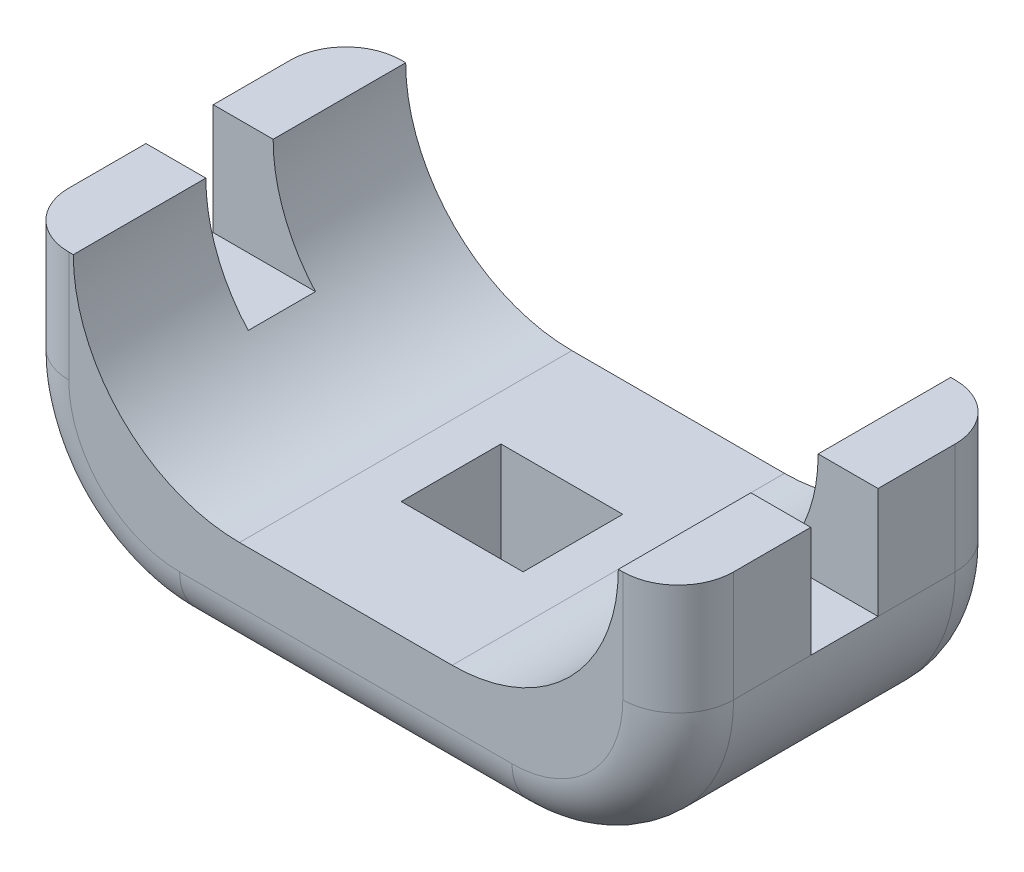
ISO-10303-21;
HEADER;
FILE_DESCRIPTION(('STEP AP214'),'2;1');
FILE_NAME('part.step','',(''),(''),'','','');
FILE_SCHEMA(('AUTOMOTIVE_DESIGN { 1 0 10303 214 1 1 1 1 }'));
ENDSEC;
DATA;
#1=APPLICATION_CONTEXT('core data for automotive mechanical design processes');
#2=APPLICATION_PROTOCOL_DEFINITION('international standard','automotive_design',2000,#1);
#3=PRODUCT_CONTEXT('',#1,'mechanical');
#4=PRODUCT('Part','Part','',(#3));
#5=PRODUCT_RELATED_PRODUCT_CATEGORY('part','',(#4));
#6=PRODUCT_DEFINITION_FORMATION('','',#4);
#7=PRODUCT_DEFINITION_CONTEXT('part definition',#1,'design');
#8=PRODUCT_DEFINITION('design','',#6,#7);
#9=PRODUCT_DEFINITION_SHAPE('','',#8);
#10=(LENGTH_UNIT() NAMED_UNIT(*) SI_UNIT(.MILLI.,.METRE.));
#11=(NAMED_UNIT(*) PLANE_ANGLE_UNIT() SI_UNIT($,.RADIAN.));
#12=(NAMED_UNIT(*) SI_UNIT($,.STERADIAN.) SOLID_ANGLE_UNIT());
#13=UNCERTAINTY_MEASURE_WITH_UNIT(LENGTH_MEASURE(1.E-05),#10,'distance_accuracy_value','');
#14=(GEOMETRIC_REPRESENTATION_CONTEXT(3) GLOBAL_UNCERTAINTY_ASSIGNED_CONTEXT((#13)) GLOBAL_UNIT_ASSIGNED_CONTEXT((#10,
#11,#12)) REPRESENTATION_CONTEXT('',''));
#15=CARTESIAN_POINT('',(0.,0.,0.));
#16=DIRECTION('',(0.,0.,1.));
#17=DIRECTION('',(1.,0.,0.));
#18=AXIS2_PLACEMENT_3D('',#15,#16,#17);
#19=CARTESIAN_POINT('',(0.,5.,0.));
#20=DIRECTION('',(0.,1.,0.));
#21=DIRECTION('',(0.,0.,1.));
#22=AXIS2_PLACEMENT_3D('',#19,#20,#21);
#23=PLANE('',#22);
#24=DIRECTION('',(1.,0.,0.));
#25=VECTOR('',#24,1.);
#26=CARTESIAN_POINT('',(-6.,5.,0.607288579290806));
#27=LINE('',#26,#25);
#28=CARTESIAN_POINT('',(4.91903749225539,5.,0.607288579290806));
#29=VERTEX_POINT('',#28);
#30=CARTESIAN_POINT('',(6.,5.,0.607288579290806));
#31=VERTEX_POINT('',#30);
#32=EDGE_CURVE('E395',#29,#31,#27,.T.);
#33=ORIENTED_EDGE('',*,*,#32,.F.);
#34=DIRECTION('',(0.,0.,-1.));
#35=VECTOR('',#34,1.);
#36=CARTESIAN_POINT('',(4.9190374922554,5.,3.));
#37=LINE('',#36,#35);
#38=CARTESIAN_POINT('',(4.9190374922554,5.,3.));
#39=VERTEX_POINT('',#38);
#40=EDGE_CURVE('E418',#39,#29,#37,.T.);
#41=ORIENTED_EDGE('',*,*,#40,.F.);
#42=DIRECTION('',(1.,0.,0.));
#43=VECTOR('',#42,1.);
#44=CARTESIAN_POINT('',(6.,5.,3.));
#45=LINE('',#44,#43);
#46=CARTESIAN_POINT('',(5.,5.,3.));
#47=VERTEX_POINT('',#46);
#48=EDGE_CURVE('E453',#39,#47,#45,.T.);
#49=ORIENTED_EDGE('',*,*,#48,.T.);
#50=CARTESIAN_POINT('',(5.,5.,2.));
#51=DIRECTION('',(0.,1.,0.));
#52=DIRECTION('',(0.,0.,1.));
#53=AXIS2_PLACEMENT_3D('',#50,#51,#52);
#54=CIRCLE('',#53,1.);
#55=CARTESIAN_POINT('',(6.,5.,2.));
#56=VERTEX_POINT('',#55);
#57=EDGE_CURVE('E356',#47,#56,#54,.T.);
#58=ORIENTED_EDGE('',*,*,#57,.T.);
#59=DIRECTION('',(0.,0.,-1.));
#60=VECTOR('',#59,1.);
#61=CARTESIAN_POINT('',(6.,5.,3.));
#62=LINE('',#61,#60);
#63=EDGE_CURVE('E456',#56,#31,#62,.T.);
#64=ORIENTED_EDGE('',*,*,#63,.T.);
#65=EDGE_LOOP('',(#33,#41,#49,#58,#64));
#66=FACE_BOUND('',#65,.T.);
#67=ADVANCED_FACE('F40',(#66),#23,.T.);
#68=CARTESIAN_POINT('',(-6.,5.,3.));
#69=DIRECTION('',(1.,0.,0.));
#70=DIRECTION('',(0.,0.,-1.));
#71=AXIS2_PLACEMENT_3D('',#68,#69,#70);
#72=PLANE('',#71);
#73=DIRECTION('',(0.,0.,1.));
#74=VECTOR('',#73,1.);
#75=CARTESIAN_POINT('',(-6.,5.,3.));
#76=LINE('',#75,#74);
#77=CARTESIAN_POINT('',(-6.,5.,0.607288579290806));
#78=VERTEX_POINT('',#77);
#79=CARTESIAN_POINT('',(-6.,5.,2.));
#80=VERTEX_POINT('',#79);
#81=EDGE_CURVE('E446',#78,#80,#76,.T.);
#82=ORIENTED_EDGE('',*,*,#81,.F.);
#83=DIRECTION('',(0.,1.,0.));
#84=VECTOR('',#83,1.);
#85=CARTESIAN_POINT('',(-6.,3.,0.607288579290806));
#86=LINE('',#85,#84);
#87=CARTESIAN_POINT('',(-6.,3.,0.607288579290806));
#88=VERTEX_POINT('',#87);
#89=EDGE_CURVE('E404',#88,#78,#86,.T.);
#90=ORIENTED_EDGE('',*,*,#89,.F.);
#91=DIRECTION('',(0.,0.,1.));
#92=VECTOR('',#91,1.);
#93=CARTESIAN_POINT('',(-6.,3.,3.));
#94=LINE('',#93,#92);
#95=CARTESIAN_POINT('',(-6.,3.,2.));
#96=VERTEX_POINT('',#95);
#97=EDGE_CURVE('E272',#88,#96,#94,.T.);
#98=ORIENTED_EDGE('',*,*,#97,.T.);
#99=DIRECTION('',(0.,-1.,0.));
#100=VECTOR('',#99,1.);
#101=CARTESIAN_POINT('',(-6.,5.,2.));
#102=LINE('',#101,#100);
#103=EDGE_CURVE('E344',#96,#80,#102,.F.);
#104=ORIENTED_EDGE('',*,*,#103,.T.);
#105=EDGE_LOOP('',(#82,#90,#98,#104));
#106=FACE_BOUND('',#105,.T.);
#107=ADVANCED_FACE('F491',(#106),#72,.F.);
#108=CARTESIAN_POINT('',(6.,5.,3.));
#109=DIRECTION('',(-1.,0.,0.));
#110=DIRECTION('',(0.,0.,1.));
#111=AXIS2_PLACEMENT_3D('',#108,#109,#110);
#112=PLANE('',#111);
#113=DIRECTION('',(0.,0.,-1.));
#114=VECTOR('',#113,1.);
#115=CARTESIAN_POINT('',(6.,3.,3.));
#116=LINE('',#115,#114);
#117=CARTESIAN_POINT('',(6.,3.,2.));
#118=VERTEX_POINT('',#117);
#119=CARTESIAN_POINT('',(6.,3.,0.607288579290806));
#120=VERTEX_POINT('',#119);
#121=EDGE_CURVE('E259',#118,#120,#116,.T.);
#122=ORIENTED_EDGE('',*,*,#121,.T.);
#123=DIRECTION('',(0.,1.,0.));
#124=VECTOR('',#123,1.);
#125=CARTESIAN_POINT('',(6.,3.,0.607288579290806));
#126=LINE('',#125,#124);
#127=EDGE_CURVE('E400',#120,#31,#126,.T.);
#128=ORIENTED_EDGE('',*,*,#127,.T.);
#129=ORIENTED_EDGE('',*,*,#63,.F.);
#130=DIRECTION('',(0.,-1.,0.));
#131=VECTOR('',#130,1.);
#132=CARTESIAN_POINT('',(6.,5.,2.));
#133=LINE('',#132,#131);
#134=EDGE_CURVE('E354',#56,#118,#133,.T.);
#135=ORIENTED_EDGE('',*,*,#134,.T.);
#136=EDGE_LOOP('',(#122,#128,#129,#135));
#137=FACE_BOUND('',#136,.T.);
#138=ADVANCED_FACE('F553',(#137),#112,.F.);
#139=CARTESIAN_POINT('',(-4.9190374922554,5.,0.607288579290806));
#140=VERTEX_POINT('',#139);
#141=EDGE_CURVE('E243',#78,#140,#27,.T.);
#142=ORIENTED_EDGE('',*,*,#141,.F.);
#143=ORIENTED_EDGE('',*,*,#81,.T.);
#144=CARTESIAN_POINT('',(-5.,5.,2.));
#145=DIRECTION('',(0.,1.,0.));
#146=DIRECTION('',(0.,0.,1.));
#147=AXIS2_PLACEMENT_3D('',#144,#145,#146);
#148=CIRCLE('',#147,1.);
#149=CARTESIAN_POINT('',(-5.,5.,3.));
#150=VERTEX_POINT('',#149);
#151=EDGE_CURVE('E347',#80,#150,#148,.T.);
#152=ORIENTED_EDGE('',*,*,#151,.T.);
#153=CARTESIAN_POINT('',(-4.9190374922554,5.,3.));
#154=VERTEX_POINT('',#153);
#155=EDGE_CURVE('E454',#150,#154,#45,.T.);
#156=ORIENTED_EDGE('',*,*,#155,.T.);
#157=DIRECTION('',(0.,0.,1.));
#158=VECTOR('',#157,1.);
#159=CARTESIAN_POINT('',(-4.9190374922554,5.,3.));
#160=LINE('',#159,#158);
#161=EDGE_CURVE('E421',#140,#154,#160,.T.);
#162=ORIENTED_EDGE('',*,*,#161,.F.);
#163=EDGE_LOOP('',(#142,#143,#152,#156,#162));
#164=FACE_BOUND('',#163,.T.);
#165=ADVANCED_FACE('F512',(#164),#23,.T.);
#166=DIRECTION('',(-1.,0.,0.));
#167=VECTOR('',#166,1.);
#168=CARTESIAN_POINT('',(-6.,5.,-0.607288579290806));
#169=LINE('',#168,#167);
#170=CARTESIAN_POINT('',(6.,5.,-0.607288579290806));
#171=VERTEX_POINT('',#170);
#172=CARTESIAN_POINT('',(4.91903749225539,5.,-0.607288579290806));
#173=VERTEX_POINT('',#172);
#174=EDGE_CURVE('E393',#171,#173,#169,.T.);
#175=ORIENTED_EDGE('',*,*,#174,.F.);
#176=CARTESIAN_POINT('',(6.,5.,-2.));
#177=VERTEX_POINT('',#176);
#178=EDGE_CURVE('E251',#171,#177,#62,.T.);
#179=ORIENTED_EDGE('',*,*,#178,.T.);
#180=CARTESIAN_POINT('',(5.,5.,-2.));
#181=DIRECTION('',(0.,1.,0.));
#182=DIRECTION('',(0.,0.,1.));
#183=AXIS2_PLACEMENT_3D('',#180,#181,#182);
#184=CIRCLE('',#183,1.);
#185=CARTESIAN_POINT('',(5.,5.,-3.));
#186=VERTEX_POINT('',#185);
#187=EDGE_CURVE('E308',#177,#186,#184,.T.);
#188=ORIENTED_EDGE('',*,*,#187,.T.);
#189=DIRECTION('',(-1.,0.,0.));
#190=VECTOR('',#189,1.);
#191=CARTESIAN_POINT('',(6.,5.,-3.));
#192=LINE('',#191,#190);
#193=CARTESIAN_POINT('',(4.9190374922554,5.,-3.));
#194=VERTEX_POINT('',#193);
#195=EDGE_CURVE('E260',#186,#194,#192,.T.);
#196=ORIENTED_EDGE('',*,*,#195,.T.);
#197=EDGE_CURVE('E333',#173,#194,#37,.T.);
#198=ORIENTED_EDGE('',*,*,#197,.F.);
#199=EDGE_LOOP('',(#175,#179,#188,#196,#198));
#200=FACE_BOUND('',#199,.T.);
#201=ADVANCED_FACE('F462',(#200),#23,.T.);
#202=CARTESIAN_POINT('',(-6.,3.,-2.));
#203=VERTEX_POINT('',#202);
#204=CARTESIAN_POINT('',(-6.,3.,-0.607288579290806));
#205=VERTEX_POINT('',#204);
#206=EDGE_CURVE('E273',#203,#205,#94,.T.);
#207=ORIENTED_EDGE('',*,*,#206,.T.);
#208=DIRECTION('',(0.,1.,0.));
#209=VECTOR('',#208,1.);
#210=CARTESIAN_POINT('',(-6.,3.,-0.607288579290806));
#211=LINE('',#210,#209);
#212=CARTESIAN_POINT('',(-6.,5.,-0.607288579290806));
#213=VERTEX_POINT('',#212);
#214=EDGE_CURVE('E252',#205,#213,#211,.T.);
#215=ORIENTED_EDGE('',*,*,#214,.T.);
#216=CARTESIAN_POINT('',(-6.,5.,-2.));
#217=VERTEX_POINT('',#216);
#218=EDGE_CURVE('E392',#217,#213,#76,.T.);
#219=ORIENTED_EDGE('',*,*,#218,.F.);
#220=DIRECTION('',(0.,-1.,0.));
#221=VECTOR('',#220,1.);
#222=CARTESIAN_POINT('',(-6.,5.,-2.));
#223=LINE('',#222,#221);
#224=EDGE_CURVE('E311',#217,#203,#223,.T.);
#225=ORIENTED_EDGE('',*,*,#224,.T.);
#226=EDGE_LOOP('',(#207,#215,#219,#225));
#227=FACE_BOUND('',#226,.T.);
#228=ADVANCED_FACE('F528',(#227),#72,.F.);
#229=CARTESIAN_POINT('',(6.,5.,3.));
#230=DIRECTION('',(0.,0.,-1.));
#231=DIRECTION('',(-1.,0.,0.));
#232=AXIS2_PLACEMENT_3D('',#229,#230,#231);
#233=PLANE('',#232);
#234=ORIENTED_EDGE('',*,*,#155,.F.);
#235=DIRECTION('',(0.,-1.,0.));
#236=VECTOR('',#235,1.);
#237=CARTESIAN_POINT('',(-5.,5.,3.));
#238=LINE('',#237,#236);
#239=CARTESIAN_POINT('',(-5.,3.,3.));
#240=VERTEX_POINT('',#239);
#241=EDGE_CURVE('E341',#150,#240,#238,.T.);
#242=ORIENTED_EDGE('',*,*,#241,.T.);
#243=CARTESIAN_POINT('',(-3.,3.,3.));
#244=DIRECTION('',(0.,0.,-1.));
#245=DIRECTION('',(-1.,0.,0.));
#246=AXIS2_PLACEMENT_3D('',#243,#244,#245);
#247=CIRCLE('',#246,2.);
#248=CARTESIAN_POINT('',(-3.,1.,3.));
#249=VERTEX_POINT('',#248);
#250=EDGE_CURVE('E339',#240,#249,#247,.F.);
#251=ORIENTED_EDGE('',*,*,#250,.T.);
#252=DIRECTION('',(1.,0.,0.));
#253=VECTOR('',#252,1.);
#254=CARTESIAN_POINT('',(6.,1.,3.));
#255=LINE('',#254,#253);
#256=CARTESIAN_POINT('',(3.,1.,3.));
#257=VERTEX_POINT('',#256);
#258=EDGE_CURVE('E337',#249,#257,#255,.T.);
#259=ORIENTED_EDGE('',*,*,#258,.T.);
#260=CARTESIAN_POINT('',(3.,3.,3.));
#261=DIRECTION('',(0.,0.,-1.));
#262=DIRECTION('',(-1.,0.,0.));
#263=AXIS2_PLACEMENT_3D('',#260,#261,#262);
#264=CIRCLE('',#263,2.);
#265=CARTESIAN_POINT('',(5.,3.,3.));
#266=VERTEX_POINT('',#265);
#267=EDGE_CURVE('E320',#257,#266,#264,.F.);
#268=ORIENTED_EDGE('',*,*,#267,.T.);
#269=DIRECTION('',(0.,-1.,0.));
#270=VECTOR('',#269,1.);
#271=CARTESIAN_POINT('',(5.,5.,3.));
#272=LINE('',#271,#270);
#273=EDGE_CURVE('E335',#266,#47,#272,.F.);
#274=ORIENTED_EDGE('',*,*,#273,.T.);
#275=ORIENTED_EDGE('',*,*,#48,.F.);
#276=CARTESIAN_POINT('',(1.9190374922554,5.,3.));
#277=DIRECTION('',(0.,0.,-1.));
#278=DIRECTION('',(-1.,0.,0.));
#279=AXIS2_PLACEMENT_3D('',#276,#277,#278);
#280=CIRCLE('',#279,3.);
#281=CARTESIAN_POINT('',(1.9190374922554,2.,3.));
#282=VERTEX_POINT('',#281);
#283=EDGE_CURVE('E288',#39,#282,#280,.T.);
#284=ORIENTED_EDGE('',*,*,#283,.T.);
#285=DIRECTION('',(1.,0.,0.));
#286=VECTOR('',#285,1.);
#287=CARTESIAN_POINT('',(-4.9190374922554,2.,3.));
#288=LINE('',#287,#286);
#289=CARTESIAN_POINT('',(-1.9190374922554,2.,3.));
#290=VERTEX_POINT('',#289);
#291=EDGE_CURVE('E414',#290,#282,#288,.T.);
#292=ORIENTED_EDGE('',*,*,#291,.F.);
#293=CARTESIAN_POINT('',(-1.9190374922554,5.,3.));
#294=DIRECTION('',(0.,0.,-1.));
#295=DIRECTION('',(-1.,0.,0.));
#296=AXIS2_PLACEMENT_3D('',#293,#294,#295);
#297=CIRCLE('',#296,3.);
#298=EDGE_CURVE('E290',#290,#154,#297,.T.);
#299=ORIENTED_EDGE('',*,*,#298,.T.);
#300=EDGE_LOOP('',(#234,#242,#251,#259,#268,#274,#275,#284,#292,#299));
#301=FACE_BOUND('',#300,.T.);
#302=ADVANCED_FACE('F508',(#301),#233,.F.);
#303=ORIENTED_EDGE('',*,*,#178,.F.);
#304=DIRECTION('',(0.,1.,0.));
#305=VECTOR('',#304,1.);
#306=CARTESIAN_POINT('',(6.,3.,-0.607288579290806));
#307=LINE('',#306,#305);
#308=CARTESIAN_POINT('',(6.,3.,-0.607288579290806));
#309=VERTEX_POINT('',#308);
#310=EDGE_CURVE('E225',#309,#171,#307,.T.);
#311=ORIENTED_EDGE('',*,*,#310,.F.);
#312=CARTESIAN_POINT('',(6.,3.,-2.));
#313=VERTEX_POINT('',#312);
#314=EDGE_CURVE('E249',#309,#313,#116,.T.);
#315=ORIENTED_EDGE('',*,*,#314,.T.);
#316=DIRECTION('',(0.,-1.,0.));
#317=VECTOR('',#316,1.);
#318=CARTESIAN_POINT('',(6.,5.,-2.));
#319=LINE('',#318,#317);
#320=EDGE_CURVE('E306',#313,#177,#319,.F.);
#321=ORIENTED_EDGE('',*,*,#320,.T.);
#322=EDGE_LOOP('',(#303,#311,#315,#321));
#323=FACE_BOUND('',#322,.T.);
#324=ADVANCED_FACE('F247',(#323),#112,.F.);
#325=CARTESIAN_POINT('',(6.,5.,-3.));
#326=DIRECTION('',(0.,0.,1.));
#327=DIRECTION('',(1.,0.,0.));
#328=AXIS2_PLACEMENT_3D('',#325,#326,#327);
#329=PLANE('',#328);
#330=ORIENTED_EDGE('',*,*,#195,.F.);
#331=DIRECTION('',(0.,-1.,0.));
#332=VECTOR('',#331,1.);
#333=CARTESIAN_POINT('',(5.,5.,-3.));
#334=LINE('',#333,#332);
#335=CARTESIAN_POINT('',(5.,3.,-3.));
#336=VERTEX_POINT('',#335);
#337=EDGE_CURVE('E303',#186,#336,#334,.T.);
#338=ORIENTED_EDGE('',*,*,#337,.T.);
#339=CARTESIAN_POINT('',(3.,3.,-3.));
#340=DIRECTION('',(0.,0.,1.));
#341=DIRECTION('',(1.,0.,0.));
#342=AXIS2_PLACEMENT_3D('',#339,#340,#341);
#343=CIRCLE('',#342,2.);
#344=CARTESIAN_POINT('',(3.,1.,-3.));
#345=VERTEX_POINT('',#344);
#346=EDGE_CURVE('E301',#336,#345,#343,.F.);
#347=ORIENTED_EDGE('',*,*,#346,.T.);
#348=DIRECTION('',(-1.,0.,0.));
#349=VECTOR('',#348,1.);
#350=CARTESIAN_POINT('',(6.,1.,-3.));
#351=LINE('',#350,#349);
#352=CARTESIAN_POINT('',(-3.,1.,-3.));
#353=VERTEX_POINT('',#352);
#354=EDGE_CURVE('E295',#345,#353,#351,.T.);
#355=ORIENTED_EDGE('',*,*,#354,.T.);
#356=CARTESIAN_POINT('',(-3.,3.,-3.));
#357=DIRECTION('',(0.,0.,1.));
#358=DIRECTION('',(1.,0.,0.));
#359=AXIS2_PLACEMENT_3D('',#356,#357,#358);
#360=CIRCLE('',#359,2.);
#361=CARTESIAN_POINT('',(-5.,3.,-3.));
#362=VERTEX_POINT('',#361);
#363=EDGE_CURVE('E297',#353,#362,#360,.F.);
#364=ORIENTED_EDGE('',*,*,#363,.T.);
#365=DIRECTION('',(0.,-1.,0.));
#366=VECTOR('',#365,1.);
#367=CARTESIAN_POINT('',(-5.,5.,-3.));
#368=LINE('',#367,#366);
#369=CARTESIAN_POINT('',(-5.,5.,-3.));
#370=VERTEX_POINT('',#369);
#371=EDGE_CURVE('E299',#362,#370,#368,.F.);
#372=ORIENTED_EDGE('',*,*,#371,.T.);
#373=CARTESIAN_POINT('',(-4.91903749225539,5.,-3.));
#374=VERTEX_POINT('',#373);
#375=EDGE_CURVE('E264',#374,#370,#192,.T.);
#376=ORIENTED_EDGE('',*,*,#375,.F.);
#377=CARTESIAN_POINT('',(-1.9190374922554,5.,-3.));
#378=DIRECTION('',(0.,0.,1.));
#379=DIRECTION('',(1.,0.,0.));
#380=AXIS2_PLACEMENT_3D('',#377,#378,#379);
#381=CIRCLE('',#380,3.);
#382=CARTESIAN_POINT('',(-1.9190374922554,2.,-3.));
#383=VERTEX_POINT('',#382);
#384=EDGE_CURVE('E293',#374,#383,#381,.T.);
#385=ORIENTED_EDGE('',*,*,#384,.T.);
#386=DIRECTION('',(-1.,0.,0.));
#387=VECTOR('',#386,1.);
#388=CARTESIAN_POINT('',(-4.9190374922554,2.,-3.));
#389=LINE('',#388,#387);
#390=CARTESIAN_POINT('',(1.9190374922554,2.,-3.));
#391=VERTEX_POINT('',#390);
#392=EDGE_CURVE('E411',#391,#383,#389,.T.);
#393=ORIENTED_EDGE('',*,*,#392,.F.);
#394=CARTESIAN_POINT('',(1.9190374922554,5.,-3.));
#395=DIRECTION('',(0.,0.,1.));
#396=DIRECTION('',(1.,0.,0.));
#397=AXIS2_PLACEMENT_3D('',#394,#395,#396);
#398=CIRCLE('',#397,3.);
#399=EDGE_CURVE('E285',#391,#194,#398,.T.);
#400=ORIENTED_EDGE('',*,*,#399,.T.);
#401=EDGE_LOOP('',(#330,#338,#347,#355,#364,#372,#376,#385,#393,#400));
#402=FACE_BOUND('',#401,.T.);
#403=ADVANCED_FACE('F472',(#402),#329,.F.);
#404=CARTESIAN_POINT('',(-4.9190374922554,5.,-0.607288579290806));
#405=VERTEX_POINT('',#404);
#406=EDGE_CURVE('E384',#405,#213,#169,.T.);
#407=ORIENTED_EDGE('',*,*,#406,.F.);
#408=EDGE_CURVE('E378',#374,#405,#160,.T.);
#409=ORIENTED_EDGE('',*,*,#408,.F.);
#410=ORIENTED_EDGE('',*,*,#375,.T.);
#411=CARTESIAN_POINT('',(-5.,5.,-2.));
#412=DIRECTION('',(0.,1.,0.));
#413=DIRECTION('',(0.,0.,1.));
#414=AXIS2_PLACEMENT_3D('',#411,#412,#413);
#415=CIRCLE('',#414,1.);
#416=EDGE_CURVE('E313',#370,#217,#415,.T.);
#417=ORIENTED_EDGE('',*,*,#416,.T.);
#418=ORIENTED_EDGE('',*,*,#218,.T.);
#419=EDGE_LOOP('',(#407,#409,#410,#417,#418));
#420=FACE_BOUND('',#419,.T.);
#421=ADVANCED_FACE('F388',(#420),#23,.T.);
#422=CARTESIAN_POINT('',(0.,0.,0.));
#423=DIRECTION('',(0.,1.,0.));
#424=DIRECTION('',(0.,0.,1.));
#425=AXIS2_PLACEMENT_3D('',#422,#423,#424);
#426=PLANE('',#425);
#427=DIRECTION('',(-1.,0.,0.));
#428=VECTOR('',#427,1.);
#429=CARTESIAN_POINT('',(-1.1,0.,0.9));
#430=LINE('',#429,#428);
#431=CARTESIAN_POINT('',(1.1,0.,0.9));
#432=VERTEX_POINT('',#431);
#433=CARTESIAN_POINT('',(-1.1,0.,0.9));
#434=VERTEX_POINT('',#433);
#435=EDGE_CURVE('E434',#432,#434,#430,.T.);
#436=ORIENTED_EDGE('',*,*,#435,.F.);
#437=DIRECTION('',(0.,0.,1.));
#438=VECTOR('',#437,1.);
#439=CARTESIAN_POINT('',(1.1,0.,-0.9));
#440=LINE('',#439,#438);
#441=CARTESIAN_POINT('',(1.1,0.,-0.9));
#442=VERTEX_POINT('',#441);
#443=EDGE_CURVE('E431',#442,#432,#440,.T.);
#444=ORIENTED_EDGE('',*,*,#443,.F.);
#445=DIRECTION('',(1.,0.,0.));
#446=VECTOR('',#445,1.);
#447=CARTESIAN_POINT('',(-1.1,0.,-0.9));
#448=LINE('',#447,#446);
#449=CARTESIAN_POINT('',(-1.1,0.,-0.9));
#450=VERTEX_POINT('',#449);
#451=EDGE_CURVE('E440',#450,#442,#448,.T.);
#452=ORIENTED_EDGE('',*,*,#451,.F.);
#453=DIRECTION('',(0.,0.,-1.));
#454=VECTOR('',#453,1.);
#455=CARTESIAN_POINT('',(-1.1,0.,-0.9));
#456=LINE('',#455,#454);
#457=EDGE_CURVE('E437',#434,#450,#456,.T.);
#458=ORIENTED_EDGE('',*,*,#457,.F.);
#459=EDGE_LOOP('',(#436,#444,#452,#458));
#460=FACE_BOUND('',#459,.T.);
#461=DIRECTION('',(0.,0.,-1.));
#462=VECTOR('',#461,1.);
#463=CARTESIAN_POINT('',(3.,0.,0.));
#464=LINE('',#463,#462);
#465=CARTESIAN_POINT('',(3.,0.,-2.));
#466=VERTEX_POINT('',#465);
#467=CARTESIAN_POINT('',(3.,0.,2.));
#468=VERTEX_POINT('',#467);
#469=EDGE_CURVE('E269',#466,#468,#464,.F.);
#470=ORIENTED_EDGE('',*,*,#469,.T.);
#471=DIRECTION('',(1.,0.,0.));
#472=VECTOR('',#471,1.);
#473=CARTESIAN_POINT('',(0.,0.,2.));
#474=LINE('',#473,#472);
#475=CARTESIAN_POINT('',(-3.,0.,2.));
#476=VERTEX_POINT('',#475);
#477=EDGE_CURVE('E352',#468,#476,#474,.F.);
#478=ORIENTED_EDGE('',*,*,#477,.T.);
#479=DIRECTION('',(0.,0.,1.));
#480=VECTOR('',#479,1.);
#481=CARTESIAN_POINT('',(-3.,0.,0.));
#482=LINE('',#481,#480);
#483=CARTESIAN_POINT('',(-3.,0.,-2.));
#484=VERTEX_POINT('',#483);
#485=EDGE_CURVE('E262',#476,#484,#482,.F.);
#486=ORIENTED_EDGE('',*,*,#485,.T.);
#487=DIRECTION('',(-1.,0.,0.));
#488=VECTOR('',#487,1.);
#489=CARTESIAN_POINT('',(0.,0.,-2.));
#490=LINE('',#489,#488);
#491=EDGE_CURVE('E318',#484,#466,#490,.F.);
#492=ORIENTED_EDGE('',*,*,#491,.T.);
#493=EDGE_LOOP('',(#470,#478,#486,#492));
#494=FACE_BOUND('',#493,.T.);
#495=ADVANCED_FACE('F538',(#460,#494),#426,.F.);
#496=CARTESIAN_POINT('',(1.1,5.,-0.9));
#497=DIRECTION('',(1.,0.,0.));
#498=DIRECTION('',(0.,0.,-1.));
#499=AXIS2_PLACEMENT_3D('',#496,#497,#498);
#500=PLANE('',#499);
#501=DIRECTION('',(0.,-1.,0.));
#502=VECTOR('',#501,1.);
#503=CARTESIAN_POINT('',(1.1,5.,0.9));
#504=LINE('',#503,#502);
#505=CARTESIAN_POINT('',(1.1,2.,0.9));
#506=VERTEX_POINT('',#505);
#507=EDGE_CURVE('E443',#506,#432,#504,.T.);
#508=ORIENTED_EDGE('',*,*,#507,.F.);
#509=DIRECTION('',(0.,0.,-1.));
#510=VECTOR('',#509,1.);
#511=CARTESIAN_POINT('',(1.1,2.,-0.9));
#512=LINE('',#511,#510);
#513=CARTESIAN_POINT('',(1.1,2.,-0.9));
#514=VERTEX_POINT('',#513);
#515=EDGE_CURVE('E428',#506,#514,#512,.T.);
#516=ORIENTED_EDGE('',*,*,#515,.T.);
#517=DIRECTION('',(0.,-1.,0.));
#518=VECTOR('',#517,1.);
#519=CARTESIAN_POINT('',(1.1,5.,-0.9));
#520=LINE('',#519,#518);
#521=EDGE_CURVE('E444',#514,#442,#520,.T.);
#522=ORIENTED_EDGE('',*,*,#521,.T.);
#523=ORIENTED_EDGE('',*,*,#443,.T.);
#524=EDGE_LOOP('',(#508,#516,#522,#523));
#525=FACE_BOUND('',#524,.T.);
#526=ADVANCED_FACE('F575',(#525),#500,.F.);
#527=CARTESIAN_POINT('',(-1.1,5.,-0.9));
#528=DIRECTION('',(0.,0.,-1.));
#529=DIRECTION('',(-1.,0.,0.));
#530=AXIS2_PLACEMENT_3D('',#527,#528,#529);
#531=PLANE('',#530);
#532=ORIENTED_EDGE('',*,*,#521,.F.);
#533=DIRECTION('',(-1.,0.,0.));
#534=VECTOR('',#533,1.);
#535=CARTESIAN_POINT('',(-1.1,2.,-0.9));
#536=LINE('',#535,#534);
#537=CARTESIAN_POINT('',(-1.1,2.,-0.9));
#538=VERTEX_POINT('',#537);
#539=EDGE_CURVE('E425',#514,#538,#536,.T.);
#540=ORIENTED_EDGE('',*,*,#539,.T.);
#541=DIRECTION('',(0.,-1.,0.));
#542=VECTOR('',#541,1.);
#543=CARTESIAN_POINT('',(-1.1,5.,-0.9));
#544=LINE('',#543,#542);
#545=EDGE_CURVE('E447',#538,#450,#544,.T.);
#546=ORIENTED_EDGE('',*,*,#545,.T.);
#547=ORIENTED_EDGE('',*,*,#451,.T.);
#548=EDGE_LOOP('',(#532,#540,#546,#547));
#549=FACE_BOUND('',#548,.T.);
#550=ADVANCED_FACE('F677',(#549),#531,.F.);
#551=CARTESIAN_POINT('',(-1.1,5.,-0.9));
#552=DIRECTION('',(-1.,0.,0.));
#553=DIRECTION('',(0.,0.,1.));
#554=AXIS2_PLACEMENT_3D('',#551,#552,#553);
#555=PLANE('',#554);
#556=ORIENTED_EDGE('',*,*,#545,.F.);
#557=DIRECTION('',(0.,0.,1.));
#558=VECTOR('',#557,1.);
#559=CARTESIAN_POINT('',(-1.1,2.,-0.9));
#560=LINE('',#559,#558);
#561=CARTESIAN_POINT('',(-1.1,2.,0.9));
#562=VERTEX_POINT('',#561);
#563=EDGE_CURVE('E417',#538,#562,#560,.T.);
#564=ORIENTED_EDGE('',*,*,#563,.T.);
#565=DIRECTION('',(0.,-1.,0.));
#566=VECTOR('',#565,1.);
#567=CARTESIAN_POINT('',(-1.1,5.,0.9));
#568=LINE('',#567,#566);
#569=EDGE_CURVE('E449',#562,#434,#568,.T.);
#570=ORIENTED_EDGE('',*,*,#569,.T.);
#571=ORIENTED_EDGE('',*,*,#457,.T.);
#572=EDGE_LOOP('',(#556,#564,#570,#571));
#573=FACE_BOUND('',#572,.T.);
#574=ADVANCED_FACE('F669',(#573),#555,.F.);
#575=CARTESIAN_POINT('',(-1.1,5.,0.9));
#576=DIRECTION('',(0.,0.,1.));
#577=DIRECTION('',(1.,0.,0.));
#578=AXIS2_PLACEMENT_3D('',#575,#576,#577);
#579=PLANE('',#578);
#580=ORIENTED_EDGE('',*,*,#569,.F.);
#581=DIRECTION('',(1.,0.,0.));
#582=VECTOR('',#581,1.);
#583=CARTESIAN_POINT('',(-1.1,2.,0.9));
#584=LINE('',#583,#582);
#585=EDGE_CURVE('E276',#562,#506,#584,.T.);
#586=ORIENTED_EDGE('',*,*,#585,.T.);
#587=ORIENTED_EDGE('',*,*,#507,.T.);
#588=ORIENTED_EDGE('',*,*,#435,.T.);
#589=EDGE_LOOP('',(#580,#586,#587,#588));
#590=FACE_BOUND('',#589,.T.);
#591=ADVANCED_FACE('F587',(#590),#579,.F.);
#592=CARTESIAN_POINT('',(3.,3.,3.));
#593=DIRECTION('',(0.,0.,-1.));
#594=DIRECTION('',(-1.,0.,0.));
#595=AXIS2_PLACEMENT_3D('',#592,#593,#594);
#596=CYLINDRICAL_SURFACE('',#595,3.);
#597=ORIENTED_EDGE('',*,*,#121,.F.);
#598=CARTESIAN_POINT('',(3.,3.,2.));
#599=DIRECTION('',(0.,0.,-1.));
#600=DIRECTION('',(-1.,0.,0.));
#601=AXIS2_PLACEMENT_3D('',#598,#599,#600);
#602=CIRCLE('',#601,3.);
#603=EDGE_CURVE('E358',#118,#468,#602,.T.);
#604=ORIENTED_EDGE('',*,*,#603,.T.);
#605=ORIENTED_EDGE('',*,*,#469,.F.);
#606=CARTESIAN_POINT('',(3.,3.,-2.));
#607=DIRECTION('',(0.,0.,1.));
#608=DIRECTION('',(1.,0.,0.));
#609=AXIS2_PLACEMENT_3D('',#606,#607,#608);
#610=CIRCLE('',#609,3.);
#611=EDGE_CURVE('E257',#466,#313,#610,.T.);
#612=ORIENTED_EDGE('',*,*,#611,.T.);
#613=ORIENTED_EDGE('',*,*,#314,.F.);
#614=DIRECTION('',(0.,0.,-1.));
#615=VECTOR('',#614,1.);
#616=CARTESIAN_POINT('',(6.,3.,0.607288579290806));
#617=LINE('',#616,#615);
#618=EDGE_CURVE('E234',#120,#309,#617,.T.);
#619=ORIENTED_EDGE('',*,*,#618,.F.);
#620=EDGE_LOOP('',(#597,#604,#605,#612,#613,#619));
#621=FACE_BOUND('',#620,.T.);
#622=ADVANCED_FACE('F254',(#621),#596,.T.);
#623=CARTESIAN_POINT('',(-3.,3.,3.));
#624=DIRECTION('',(0.,0.,1.));
#625=DIRECTION('',(1.,0.,0.));
#626=AXIS2_PLACEMENT_3D('',#623,#624,#625);
#627=CYLINDRICAL_SURFACE('',#626,3.);
#628=ORIENTED_EDGE('',*,*,#485,.F.);
#629=CARTESIAN_POINT('',(-3.,3.,2.));
#630=DIRECTION('',(0.,0.,-1.));
#631=DIRECTION('',(-1.,0.,0.));
#632=AXIS2_PLACEMENT_3D('',#629,#630,#631);
#633=CIRCLE('',#632,3.);
#634=EDGE_CURVE('E349',#476,#96,#633,.T.);
#635=ORIENTED_EDGE('',*,*,#634,.T.);
#636=ORIENTED_EDGE('',*,*,#97,.F.);
#637=DIRECTION('',(0.,0.,1.));
#638=VECTOR('',#637,1.);
#639=CARTESIAN_POINT('',(-6.,3.,0.607288579290806));
#640=LINE('',#639,#638);
#641=EDGE_CURVE('E230',#205,#88,#640,.T.);
#642=ORIENTED_EDGE('',*,*,#641,.F.);
#643=ORIENTED_EDGE('',*,*,#206,.F.);
#644=CARTESIAN_POINT('',(-3.,3.,-2.));
#645=DIRECTION('',(0.,0.,1.));
#646=DIRECTION('',(1.,0.,0.));
#647=AXIS2_PLACEMENT_3D('',#644,#645,#646);
#648=CIRCLE('',#647,3.);
#649=EDGE_CURVE('E315',#203,#484,#648,.T.);
#650=ORIENTED_EDGE('',*,*,#649,.T.);
#651=EDGE_LOOP('',(#628,#635,#636,#642,#643,#650));
#652=FACE_BOUND('',#651,.T.);
#653=ADVANCED_FACE('F493',(#652),#627,.T.);
#654=CARTESIAN_POINT('',(0.,2.,0.));
#655=DIRECTION('',(0.,-1.,0.));
#656=DIRECTION('',(0.,0.,-1.));
#657=AXIS2_PLACEMENT_3D('',#654,#655,#656);
#658=PLANE('',#657);
#659=ORIENTED_EDGE('',*,*,#291,.T.);
#660=DIRECTION('',(0.,0.,-1.));
#661=VECTOR('',#660,1.);
#662=CARTESIAN_POINT('',(1.9190374922554,2.,-3.));
#663=LINE('',#662,#661);
#664=EDGE_CURVE('E282',#282,#391,#663,.T.);
#665=ORIENTED_EDGE('',*,*,#664,.T.);
#666=ORIENTED_EDGE('',*,*,#392,.T.);
#667=DIRECTION('',(0.,0.,1.));
#668=VECTOR('',#667,1.);
#669=CARTESIAN_POINT('',(-1.9190374922554,2.,3.));
#670=LINE('',#669,#668);
#671=EDGE_CURVE('E279',#383,#290,#670,.T.);
#672=ORIENTED_EDGE('',*,*,#671,.T.);
#673=EDGE_LOOP('',(#659,#665,#666,#672));
#674=FACE_BOUND('',#673,.T.);
#675=ORIENTED_EDGE('',*,*,#585,.F.);
#676=ORIENTED_EDGE('',*,*,#563,.F.);
#677=ORIENTED_EDGE('',*,*,#539,.F.);
#678=ORIENTED_EDGE('',*,*,#515,.F.);
#679=EDGE_LOOP('',(#675,#676,#677,#678));
#680=FACE_BOUND('',#679,.T.);
#681=ADVANCED_FACE('F515',(#674,#680),#658,.F.);
#682=CARTESIAN_POINT('',(1.9190374922554,5.,0.));
#683=DIRECTION('',(0.,0.,1.));
#684=DIRECTION('',(1.,0.,0.));
#685=AXIS2_PLACEMENT_3D('',#682,#683,#684);
#686=CYLINDRICAL_SURFACE('',#685,3.);
#687=ORIENTED_EDGE('',*,*,#40,.T.);
#688=CARTESIAN_POINT('',(1.9190374922554,5.,0.607288579290806));
#689=DIRECTION('',(0.,0.,1.));
#690=DIRECTION('',(1.,0.,0.));
#691=AXIS2_PLACEMENT_3D('',#688,#689,#690);
#692=CIRCLE('',#691,3.);
#693=CARTESIAN_POINT('',(4.15510546975518,3.,0.607288579290806));
#694=VERTEX_POINT('',#693);
#695=EDGE_CURVE('E364',#29,#694,#692,.F.);
#696=ORIENTED_EDGE('',*,*,#695,.T.);
#697=DIRECTION('',(0.,0.,1.));
#698=VECTOR('',#697,1.);
#699=CARTESIAN_POINT('',(4.15510546975519,3.,0.));
#700=LINE('',#699,#698);
#701=CARTESIAN_POINT('',(4.15510546975519,3.,-0.607288579290806));
#702=VERTEX_POINT('',#701);
#703=EDGE_CURVE('E403',#694,#702,#700,.F.);
#704=ORIENTED_EDGE('',*,*,#703,.T.);
#705=CARTESIAN_POINT('',(1.9190374922554,5.,-0.607288579290806));
#706=DIRECTION('',(0.,0.,-1.));
#707=DIRECTION('',(-1.,0.,0.));
#708=AXIS2_PLACEMENT_3D('',#705,#706,#707);
#709=CIRCLE('',#708,3.);
#710=EDGE_CURVE('E228',#702,#173,#709,.F.);
#711=ORIENTED_EDGE('',*,*,#710,.T.);
#712=ORIENTED_EDGE('',*,*,#197,.T.);
#713=ORIENTED_EDGE('',*,*,#399,.F.);
#714=ORIENTED_EDGE('',*,*,#664,.F.);
#715=ORIENTED_EDGE('',*,*,#283,.F.);
#716=EDGE_LOOP('',(#687,#696,#704,#711,#712,#713,#714,#715));
#717=FACE_BOUND('',#716,.T.);
#718=ADVANCED_FACE('F476',(#717),#686,.F.);
#719=CARTESIAN_POINT('',(-1.9190374922554,5.,0.));
#720=DIRECTION('',(0.,0.,-1.));
#721=DIRECTION('',(-1.,0.,0.));
#722=AXIS2_PLACEMENT_3D('',#719,#720,#721);
#723=CYLINDRICAL_SURFACE('',#722,3.);
#724=DIRECTION('',(0.,0.,-1.));
#725=VECTOR('',#724,1.);
#726=CARTESIAN_POINT('',(-4.15510546975519,3.,0.));
#727=LINE('',#726,#725);
#728=CARTESIAN_POINT('',(-4.15510546975519,3.,-0.607288579290806));
#729=VERTEX_POINT('',#728);
#730=CARTESIAN_POINT('',(-4.15510546975519,3.,0.607288579290806));
#731=VERTEX_POINT('',#730);
#732=EDGE_CURVE('E360',#729,#731,#727,.F.);
#733=ORIENTED_EDGE('',*,*,#732,.T.);
#734=CARTESIAN_POINT('',(-1.9190374922554,5.,0.607288579290806));
#735=DIRECTION('',(0.,0.,1.));
#736=DIRECTION('',(1.,0.,0.));
#737=AXIS2_PLACEMENT_3D('',#734,#735,#736);
#738=CIRCLE('',#737,3.);
#739=EDGE_CURVE('E11',#731,#140,#738,.F.);
#740=ORIENTED_EDGE('',*,*,#739,.T.);
#741=ORIENTED_EDGE('',*,*,#161,.T.);
#742=ORIENTED_EDGE('',*,*,#298,.F.);
#743=ORIENTED_EDGE('',*,*,#671,.F.);
#744=ORIENTED_EDGE('',*,*,#384,.F.);
#745=ORIENTED_EDGE('',*,*,#408,.T.);
#746=CARTESIAN_POINT('',(-1.9190374922554,5.,-0.607288579290806));
#747=DIRECTION('',(0.,0.,-1.));
#748=DIRECTION('',(-1.,0.,0.));
#749=AXIS2_PLACEMENT_3D('',#746,#747,#748);
#750=CIRCLE('',#749,3.);
#751=EDGE_CURVE('E48',#405,#729,#750,.F.);
#752=ORIENTED_EDGE('',*,*,#751,.T.);
#753=EDGE_LOOP('',(#733,#740,#741,#742,#743,#744,#745,#752));
#754=FACE_BOUND('',#753,.T.);
#755=ADVANCED_FACE('F376',(#754),#723,.F.);
#756=CARTESIAN_POINT('',(-5.,5.,-2.));
#757=DIRECTION('',(0.,-1.,0.));
#758=DIRECTION('',(0.,0.,-1.));
#759=AXIS2_PLACEMENT_3D('',#756,#757,#758);
#760=CYLINDRICAL_SURFACE('',#759,1.);
#761=ORIENTED_EDGE('',*,*,#416,.F.);
#762=ORIENTED_EDGE('',*,*,#371,.F.);
#763=CARTESIAN_POINT('',(-5.,3.,-2.));
#764=DIRECTION('',(0.,-1.,0.));
#765=DIRECTION('',(0.,0.,-1.));
#766=AXIS2_PLACEMENT_3D('',#763,#764,#765);
#767=CIRCLE('',#766,1.);
#768=EDGE_CURVE('E330',#203,#362,#767,.T.);
#769=ORIENTED_EDGE('',*,*,#768,.F.);
#770=ORIENTED_EDGE('',*,*,#224,.F.);
#771=EDGE_LOOP('',(#761,#762,#769,#770));
#772=FACE_BOUND('',#771,.T.);
#773=ADVANCED_FACE('F524',(#772),#760,.T.);
#774=CARTESIAN_POINT('',(-3.,3.,-2.));
#775=DIRECTION('',(0.,0.,1.));
#776=DIRECTION('',(1.,0.,0.));
#777=AXIS2_PLACEMENT_3D('',#774,#775,#776);
#778=TOROIDAL_SURFACE('',#777,2.,1.);
#779=ORIENTED_EDGE('',*,*,#768,.T.);
#780=ORIENTED_EDGE('',*,*,#363,.F.);
#781=CARTESIAN_POINT('',(-3.,1.,-2.));
#782=DIRECTION('',(1.,0.,0.));
#783=DIRECTION('',(0.,0.,-1.));
#784=AXIS2_PLACEMENT_3D('',#781,#782,#783);
#785=CIRCLE('',#784,1.);
#786=EDGE_CURVE('E327',#484,#353,#785,.T.);
#787=ORIENTED_EDGE('',*,*,#786,.F.);
#788=ORIENTED_EDGE('',*,*,#649,.F.);
#789=EDGE_LOOP('',(#779,#780,#787,#788));
#790=FACE_BOUND('',#789,.T.);
#791=ADVANCED_FACE('F533',(#790),#778,.T.);
#792=CARTESIAN_POINT('',(6.,1.,-2.));
#793=DIRECTION('',(-1.,0.,0.));
#794=DIRECTION('',(0.,0.,1.));
#795=AXIS2_PLACEMENT_3D('',#792,#793,#794);
#796=CYLINDRICAL_SURFACE('',#795,1.);
#797=ORIENTED_EDGE('',*,*,#786,.T.);
#798=ORIENTED_EDGE('',*,*,#354,.F.);
#799=CARTESIAN_POINT('',(3.,1.,-2.));
#800=DIRECTION('',(1.,0.,0.));
#801=DIRECTION('',(0.,0.,-1.));
#802=AXIS2_PLACEMENT_3D('',#799,#800,#801);
#803=CIRCLE('',#802,1.);
#804=EDGE_CURVE('E323',#466,#345,#803,.T.);
#805=ORIENTED_EDGE('',*,*,#804,.F.);
#806=ORIENTED_EDGE('',*,*,#491,.F.);
#807=EDGE_LOOP('',(#797,#798,#805,#806));
#808=FACE_BOUND('',#807,.T.);
#809=ADVANCED_FACE('F536',(#808),#796,.T.);
#810=CARTESIAN_POINT('',(3.,3.,-2.));
#811=DIRECTION('',(0.,0.,1.));
#812=DIRECTION('',(1.,0.,0.));
#813=AXIS2_PLACEMENT_3D('',#810,#811,#812);
#814=TOROIDAL_SURFACE('',#813,2.,1.);
#815=ORIENTED_EDGE('',*,*,#804,.T.);
#816=ORIENTED_EDGE('',*,*,#346,.F.);
#817=CARTESIAN_POINT('',(5.,3.,-2.));
#818=DIRECTION('',(0.,1.,0.));
#819=DIRECTION('',(0.,0.,1.));
#820=AXIS2_PLACEMENT_3D('',#817,#818,#819);
#821=CIRCLE('',#820,1.);
#822=EDGE_CURVE('E321',#313,#336,#821,.T.);
#823=ORIENTED_EDGE('',*,*,#822,.F.);
#824=ORIENTED_EDGE('',*,*,#611,.F.);
#825=EDGE_LOOP('',(#815,#816,#823,#824));
#826=FACE_BOUND('',#825,.T.);
#827=ADVANCED_FACE('F596',(#826),#814,.T.);
#828=CARTESIAN_POINT('',(5.,5.,-2.));
#829=DIRECTION('',(0.,-1.,0.));
#830=DIRECTION('',(0.,0.,-1.));
#831=AXIS2_PLACEMENT_3D('',#828,#829,#830);
#832=CYLINDRICAL_SURFACE('',#831,1.);
#833=ORIENTED_EDGE('',*,*,#187,.F.);
#834=ORIENTED_EDGE('',*,*,#320,.F.);
#835=ORIENTED_EDGE('',*,*,#822,.T.);
#836=ORIENTED_EDGE('',*,*,#337,.F.);
#837=EDGE_LOOP('',(#833,#834,#835,#836));
#838=FACE_BOUND('',#837,.T.);
#839=ADVANCED_FACE('F469',(#838),#832,.T.);
#840=CARTESIAN_POINT('',(5.,5.,2.));
#841=DIRECTION('',(0.,-1.,0.));
#842=DIRECTION('',(0.,0.,-1.));
#843=AXIS2_PLACEMENT_3D('',#840,#841,#842);
#844=CYLINDRICAL_SURFACE('',#843,1.);
#845=ORIENTED_EDGE('',*,*,#57,.F.);
#846=ORIENTED_EDGE('',*,*,#273,.F.);
#847=CARTESIAN_POINT('',(5.,3.,2.));
#848=DIRECTION('',(0.,-1.,0.));
#849=DIRECTION('',(0.,0.,-1.));
#850=AXIS2_PLACEMENT_3D('',#847,#848,#849);
#851=CIRCLE('',#850,1.);
#852=EDGE_CURVE('E324',#118,#266,#851,.T.);
#853=ORIENTED_EDGE('',*,*,#852,.F.);
#854=ORIENTED_EDGE('',*,*,#134,.F.);
#855=EDGE_LOOP('',(#845,#846,#853,#854));
#856=FACE_BOUND('',#855,.T.);
#857=ADVANCED_FACE('F42',(#856),#844,.T.);
#858=CARTESIAN_POINT('',(3.,3.,2.));
#859=DIRECTION('',(0.,0.,-1.));
#860=DIRECTION('',(-1.,0.,0.));
#861=AXIS2_PLACEMENT_3D('',#858,#859,#860);
#862=TOROIDAL_SURFACE('',#861,2.,1.);
#863=ORIENTED_EDGE('',*,*,#852,.T.);
#864=ORIENTED_EDGE('',*,*,#267,.F.);
#865=CARTESIAN_POINT('',(3.,1.,2.));
#866=DIRECTION('',(-1.,0.,0.));
#867=DIRECTION('',(0.,0.,1.));
#868=AXIS2_PLACEMENT_3D('',#865,#866,#867);
#869=CIRCLE('',#868,1.);
#870=EDGE_CURVE('E367',#468,#257,#869,.T.);
#871=ORIENTED_EDGE('',*,*,#870,.F.);
#872=ORIENTED_EDGE('',*,*,#603,.F.);
#873=EDGE_LOOP('',(#863,#864,#871,#872));
#874=FACE_BOUND('',#873,.T.);
#875=ADVANCED_FACE('F543',(#874),#862,.T.);
#876=CARTESIAN_POINT('',(6.,1.,2.));
#877=DIRECTION('',(1.,0.,0.));
#878=DIRECTION('',(0.,0.,-1.));
#879=AXIS2_PLACEMENT_3D('',#876,#877,#878);
#880=CYLINDRICAL_SURFACE('',#879,1.);
#881=ORIENTED_EDGE('',*,*,#870,.T.);
#882=ORIENTED_EDGE('',*,*,#258,.F.);
#883=CARTESIAN_POINT('',(-3.,1.,2.));
#884=DIRECTION('',(-1.,0.,0.));
#885=DIRECTION('',(0.,0.,1.));
#886=AXIS2_PLACEMENT_3D('',#883,#884,#885);
#887=CIRCLE('',#886,1.);
#888=EDGE_CURVE('E363',#476,#249,#887,.T.);
#889=ORIENTED_EDGE('',*,*,#888,.F.);
#890=ORIENTED_EDGE('',*,*,#477,.F.);
#891=EDGE_LOOP('',(#881,#882,#889,#890));
#892=FACE_BOUND('',#891,.T.);
#893=ADVANCED_FACE('F547',(#892),#880,.T.);
#894=CARTESIAN_POINT('',(-3.,3.,2.));
#895=DIRECTION('',(0.,0.,-1.));
#896=DIRECTION('',(-1.,0.,0.));
#897=AXIS2_PLACEMENT_3D('',#894,#895,#896);
#898=TOROIDAL_SURFACE('',#897,2.,1.);
#899=ORIENTED_EDGE('',*,*,#888,.T.);
#900=ORIENTED_EDGE('',*,*,#250,.F.);
#901=CARTESIAN_POINT('',(-5.,3.,2.));
#902=DIRECTION('',(0.,1.,0.));
#903=DIRECTION('',(0.,0.,1.));
#904=AXIS2_PLACEMENT_3D('',#901,#902,#903);
#905=CIRCLE('',#904,1.);
#906=EDGE_CURVE('E361',#96,#240,#905,.T.);
#907=ORIENTED_EDGE('',*,*,#906,.F.);
#908=ORIENTED_EDGE('',*,*,#634,.F.);
#909=EDGE_LOOP('',(#899,#900,#907,#908));
#910=FACE_BOUND('',#909,.T.);
#911=ADVANCED_FACE('F504',(#910),#898,.T.);
#912=CARTESIAN_POINT('',(-5.,5.,2.));
#913=DIRECTION('',(0.,-1.,0.));
#914=DIRECTION('',(0.,0.,-1.));
#915=AXIS2_PLACEMENT_3D('',#912,#913,#914);
#916=CYLINDRICAL_SURFACE('',#915,1.);
#917=ORIENTED_EDGE('',*,*,#151,.F.);
#918=ORIENTED_EDGE('',*,*,#103,.F.);
#919=ORIENTED_EDGE('',*,*,#906,.T.);
#920=ORIENTED_EDGE('',*,*,#241,.F.);
#921=EDGE_LOOP('',(#917,#918,#919,#920));
#922=FACE_BOUND('',#921,.T.);
#923=ADVANCED_FACE('F501',(#922),#916,.T.);
#924=CARTESIAN_POINT('',(0.,3.,0.));
#925=DIRECTION('',(0.,-1.,0.));
#926=DIRECTION('',(0.,0.,-1.));
#927=AXIS2_PLACEMENT_3D('',#924,#925,#926);
#928=PLANE('',#927);
#929=DIRECTION('',(-1.,0.,0.));
#930=VECTOR('',#929,1.);
#931=CARTESIAN_POINT('',(-6.,3.,-0.607288579290806));
#932=LINE('',#931,#930);
#933=EDGE_CURVE('E231',#729,#205,#932,.T.);
#934=ORIENTED_EDGE('',*,*,#933,.T.);
#935=ORIENTED_EDGE('',*,*,#641,.T.);
#936=DIRECTION('',(1.,0.,0.));
#937=VECTOR('',#936,1.);
#938=CARTESIAN_POINT('',(-6.,3.,0.607288579290806));
#939=LINE('',#938,#937);
#940=EDGE_CURVE('E63',#88,#731,#939,.T.);
#941=ORIENTED_EDGE('',*,*,#940,.T.);
#942=ORIENTED_EDGE('',*,*,#732,.F.);
#943=EDGE_LOOP('',(#934,#935,#941,#942));
#944=FACE_BOUND('',#943,.T.);
#945=ADVANCED_FACE('F481',(#944),#928,.F.);
#946=CARTESIAN_POINT('',(-6.,3.,-0.607288579290806));
#947=DIRECTION('',(0.,0.,-1.));
#948=DIRECTION('',(-1.,0.,0.));
#949=AXIS2_PLACEMENT_3D('',#946,#947,#948);
#950=PLANE('',#949);
#951=ORIENTED_EDGE('',*,*,#406,.T.);
#952=ORIENTED_EDGE('',*,*,#214,.F.);
#953=ORIENTED_EDGE('',*,*,#933,.F.);
#954=ORIENTED_EDGE('',*,*,#751,.F.);
#955=EDGE_LOOP('',(#951,#952,#953,#954));
#956=FACE_BOUND('',#955,.T.);
#957=ADVANCED_FACE('F382',(#956),#950,.F.);
#958=CARTESIAN_POINT('',(-6.,3.,0.607288579290806));
#959=DIRECTION('',(0.,0.,1.));
#960=DIRECTION('',(1.,0.,0.));
#961=AXIS2_PLACEMENT_3D('',#958,#959,#960);
#962=PLANE('',#961);
#963=ORIENTED_EDGE('',*,*,#940,.F.);
#964=ORIENTED_EDGE('',*,*,#89,.T.);
#965=ORIENTED_EDGE('',*,*,#141,.T.);
#966=ORIENTED_EDGE('',*,*,#739,.F.);
#967=EDGE_LOOP('',(#963,#964,#965,#966));
#968=FACE_BOUND('',#967,.T.);
#969=ADVANCED_FACE('F487',(#968),#962,.F.);
#970=ORIENTED_EDGE('',*,*,#32,.T.);
#971=ORIENTED_EDGE('',*,*,#127,.F.);
#972=EDGE_CURVE('E237',#694,#120,#939,.T.);
#973=ORIENTED_EDGE('',*,*,#972,.F.);
#974=ORIENTED_EDGE('',*,*,#695,.F.);
#975=EDGE_LOOP('',(#970,#971,#973,#974));
#976=FACE_BOUND('',#975,.T.);
#977=ADVANCED_FACE('F479',(#976),#962,.F.);
#978=EDGE_CURVE('E55',#309,#702,#932,.T.);
#979=ORIENTED_EDGE('',*,*,#978,.F.);
#980=ORIENTED_EDGE('',*,*,#310,.T.);
#981=ORIENTED_EDGE('',*,*,#174,.T.);
#982=ORIENTED_EDGE('',*,*,#710,.F.);
#983=EDGE_LOOP('',(#979,#980,#981,#982));
#984=FACE_BOUND('',#983,.T.);
#985=ADVANCED_FACE('F223',(#984),#950,.F.);
#986=ORIENTED_EDGE('',*,*,#972,.T.);
#987=ORIENTED_EDGE('',*,*,#618,.T.);
#988=ORIENTED_EDGE('',*,*,#978,.T.);
#989=ORIENTED_EDGE('',*,*,#703,.F.);
#990=EDGE_LOOP('',(#986,#987,#988,#989));
#991=FACE_BOUND('',#990,.T.);
#992=ADVANCED_FACE('F235',(#991),#928,.F.);
#993=CLOSED_SHELL('',(#67,#107,#138,#165,#201,#228,#302,#324,#403,#421,#495,#526,#550,#574,#591,
#622,#653,#681,#718,#755,#773,#791,#809,#827,#839,#857,#875,#893,#911,#923,#945,#957,#969,#977,
#985,#992));
#994=MANIFOLD_SOLID_BREP('B2',#993);
#995=ADVANCED_BREP_SHAPE_REPRESENTATION('',(#18,#994),#14);
#996=SHAPE_DEFINITION_REPRESENTATION(#9,#995);
ENDSEC;
END-ISO-10303-21;
